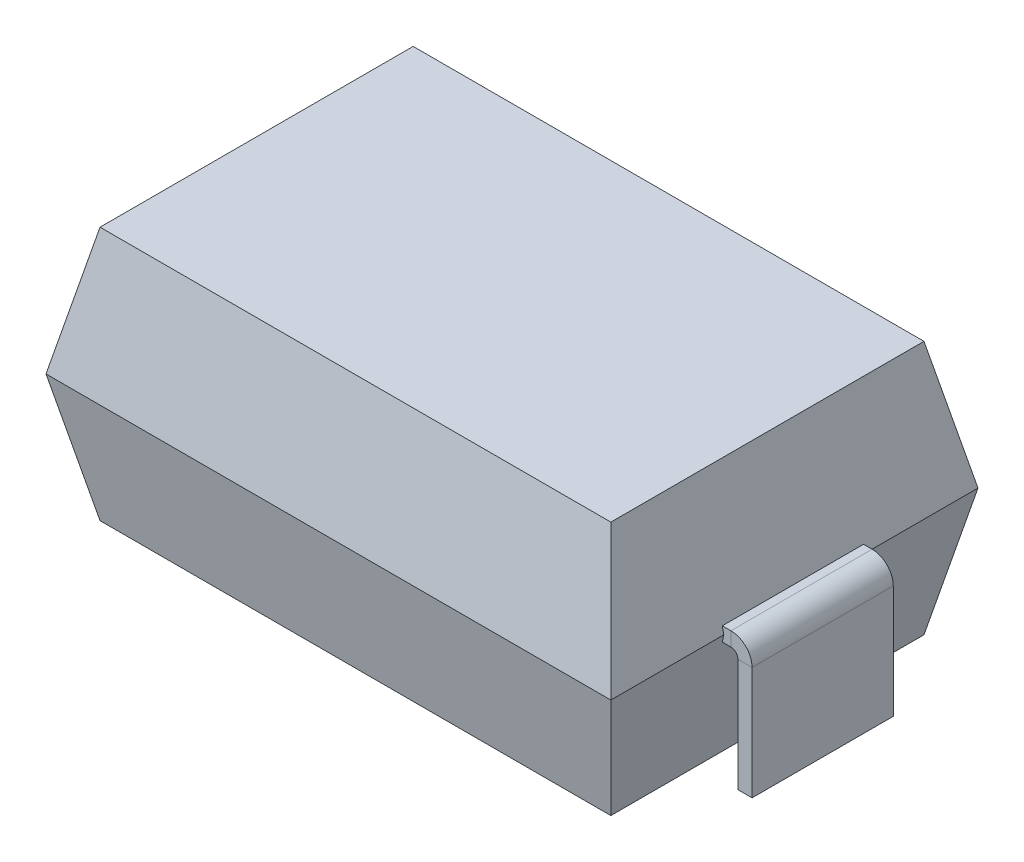
ISO-10303-21;
HEADER;
FILE_DESCRIPTION(('STEP AP214'),'2;1');
FILE_NAME('part.step','',(''),(''),'','','');
FILE_SCHEMA(('AUTOMOTIVE_DESIGN { 1 0 10303 214 1 1 1 1 }'));
ENDSEC;
DATA;
#1=APPLICATION_CONTEXT('core data for automotive mechanical design processes');
#2=APPLICATION_PROTOCOL_DEFINITION('international standard','automotive_design',2000,#1);
#3=PRODUCT_CONTEXT('',#1,'mechanical');
#4=PRODUCT('Part','Part','',(#3));
#5=PRODUCT_RELATED_PRODUCT_CATEGORY('part','',(#4));
#6=PRODUCT_DEFINITION_FORMATION('','',#4);
#7=PRODUCT_DEFINITION_CONTEXT('part definition',#1,'design');
#8=PRODUCT_DEFINITION('design','',#6,#7);
#9=PRODUCT_DEFINITION_SHAPE('','',#8);
#10=(LENGTH_UNIT() NAMED_UNIT(*) SI_UNIT(.MILLI.,.METRE.));
#11=(NAMED_UNIT(*) PLANE_ANGLE_UNIT() SI_UNIT($,.RADIAN.));
#12=(NAMED_UNIT(*) SI_UNIT($,.STERADIAN.) SOLID_ANGLE_UNIT());
#13=UNCERTAINTY_MEASURE_WITH_UNIT(LENGTH_MEASURE(1.E-05),#10,'distance_accuracy_value','');
#14=(GEOMETRIC_REPRESENTATION_CONTEXT(3) GLOBAL_UNCERTAINTY_ASSIGNED_CONTEXT((#13)) GLOBAL_UNIT_ASSIGNED_CONTEXT((#10,
#11,#12)) REPRESENTATION_CONTEXT('',''));
#15=CARTESIAN_POINT('',(0.,0.,0.));
#16=DIRECTION('',(0.,0.,1.));
#17=DIRECTION('',(1.,0.,0.));
#18=AXIS2_PLACEMENT_3D('',#15,#16,#17);
#19=CARTESIAN_POINT('',(2.,0.,-1.3));
#20=DIRECTION('',(0.978147600733806,-0.20791169081776,0.));
#21=DIRECTION('',(0.20791169081776,0.978147600733806,0.));
#22=AXIS2_PLACEMENT_3D('',#19,#20,#21);
#23=PLANE('',#22);
#24=DIRECTION('',(0.,0.,-1.));
#25=VECTOR('',#24,1.);
#26=CARTESIAN_POINT('',(2.,0.,-1.3));
#27=LINE('',#26,#25);
#28=CARTESIAN_POINT('',(2.,0.,-0.5));
#29=VERTEX_POINT('',#28);
#30=CARTESIAN_POINT('',(2.,0.,-1.3));
#31=VERTEX_POINT('',#30);
#32=EDGE_CURVE('E379',#29,#31,#27,.T.);
#33=ORIENTED_EDGE('',*,*,#32,.F.);
#34=DIRECTION('',(-0.20791169081776,-0.978147600733806,0.));
#35=VECTOR('',#34,1.);
#36=CARTESIAN_POINT('',(1.81683604466595,-0.861718659235743,-0.5));
#37=LINE('',#36,#35);
#38=CARTESIAN_POINT('',(1.9893721719165,-0.0499999999999999,-0.5));
#39=VERTEX_POINT('',#38);
#40=EDGE_CURVE('E243',#29,#39,#37,.T.);
#41=ORIENTED_EDGE('',*,*,#40,.T.);
#42=DIRECTION('',(0.,0.,1.));
#43=VECTOR('',#42,1.);
#44=CARTESIAN_POINT('',(1.9893721719165,-0.0500000000000001,0.5));
#45=LINE('',#44,#43);
#46=CARTESIAN_POINT('',(1.9893721719165,-0.0500000000000001,0.5));
#47=VERTEX_POINT('',#46);
#48=EDGE_CURVE('E233',#39,#47,#45,.T.);
#49=ORIENTED_EDGE('',*,*,#48,.T.);
#50=DIRECTION('',(0.20791169081776,0.978147600733806,0.));
#51=VECTOR('',#50,1.);
#52=CARTESIAN_POINT('',(1.83717287681974,-0.766041386353613,0.5));
#53=LINE('',#52,#51);
#54=CARTESIAN_POINT('',(2.,0.,0.5));
#55=VERTEX_POINT('',#54);
#56=EDGE_CURVE('E224',#47,#55,#53,.T.);
#57=ORIENTED_EDGE('',*,*,#56,.T.);
#58=CARTESIAN_POINT('',(2.,0.,1.3));
#59=VERTEX_POINT('',#58);
#60=EDGE_CURVE('E223',#59,#55,#27,.T.);
#61=ORIENTED_EDGE('',*,*,#60,.F.);
#62=DIRECTION('',(0.203558594952779,0.957667894857972,0.203558594952779));
#63=VECTOR('',#62,1.);
#64=CARTESIAN_POINT('',(1.8342555936834,-0.779766124434699,1.1342555936834));
#65=LINE('',#64,#63);
#66=CARTESIAN_POINT('',(1.80869909449698,-0.9,1.10869909449698));
#67=VERTEX_POINT('',#66);
#68=EDGE_CURVE('E11',#67,#59,#65,.T.);
#69=ORIENTED_EDGE('',*,*,#68,.F.);
#70=DIRECTION('',(0.,0.,-1.));
#71=VECTOR('',#70,1.);
#72=CARTESIAN_POINT('',(1.80869909449698,-0.9,0.));
#73=LINE('',#72,#71);
#74=CARTESIAN_POINT('',(1.80869909449698,-0.9,-1.10869909449698));
#75=VERTEX_POINT('',#74);
#76=EDGE_CURVE('E407',#67,#75,#73,.T.);
#77=ORIENTED_EDGE('',*,*,#76,.T.);
#78=DIRECTION('',(0.203558594952779,0.957667894857972,-0.203558594952779));
#79=VECTOR('',#78,1.);
#80=CARTESIAN_POINT('',(2.,0.,-1.3));
#81=LINE('',#80,#79);
#82=EDGE_CURVE('E409',#75,#31,#81,.T.);
#83=ORIENTED_EDGE('',*,*,#82,.T.);
#84=EDGE_LOOP('',(#33,#41,#49,#57,#61,#69,#77,#83));
#85=FACE_BOUND('',#84,.T.);
#86=ADVANCED_FACE('F37',(#85),#23,.T.);
#87=CARTESIAN_POINT('',(2.,0.,-1.3));
#88=DIRECTION('',(0.978147600733806,0.20791169081776,0.));
#89=DIRECTION('',(-0.20791169081776,0.978147600733806,0.));
#90=AXIS2_PLACEMENT_3D('',#87,#88,#89);
#91=PLANE('',#90);
#92=DIRECTION('',(0.20791169081776,-0.978147600733806,0.));
#93=VECTOR('',#92,1.);
#94=CARTESIAN_POINT('',(1.83717287681974,0.766041386353613,-0.5));
#95=LINE('',#94,#93);
#96=CARTESIAN_POINT('',(1.9893721719165,0.0500000000000001,-0.5));
#97=VERTEX_POINT('',#96);
#98=EDGE_CURVE('E54',#29,#97,#95,.F.);
#99=ORIENTED_EDGE('',*,*,#98,.F.);
#100=ORIENTED_EDGE('',*,*,#32,.T.);
#101=DIRECTION('',(0.203558594952779,-0.957667894857972,-0.203558594952779));
#102=VECTOR('',#101,1.);
#103=CARTESIAN_POINT('',(1.8342555936834,0.779766124434699,-1.1342555936834));
#104=LINE('',#103,#102);
#105=CARTESIAN_POINT('',(1.80869909449698,0.9,-1.10869909449698));
#106=VERTEX_POINT('',#105);
#107=EDGE_CURVE('E376',#106,#31,#104,.T.);
#108=ORIENTED_EDGE('',*,*,#107,.F.);
#109=DIRECTION('',(0.,0.,1.));
#110=VECTOR('',#109,1.);
#111=CARTESIAN_POINT('',(1.80869909449698,0.9,-1.3));
#112=LINE('',#111,#110);
#113=CARTESIAN_POINT('',(1.80869909449698,0.9,1.10869909449698));
#114=VERTEX_POINT('',#113);
#115=EDGE_CURVE('E375',#114,#106,#112,.F.);
#116=ORIENTED_EDGE('',*,*,#115,.F.);
#117=DIRECTION('',(0.203558594952779,-0.957667894857972,0.203558594952779));
#118=VECTOR('',#117,1.);
#119=CARTESIAN_POINT('',(1.89226613589421,0.506847980882555,1.19226613589421));
#120=LINE('',#119,#118);
#121=EDGE_CURVE('E381',#114,#59,#120,.T.);
#122=ORIENTED_EDGE('',*,*,#121,.T.);
#123=ORIENTED_EDGE('',*,*,#60,.T.);
#124=DIRECTION('',(-0.20791169081776,0.978147600733806,0.));
#125=VECTOR('',#124,1.);
#126=CARTESIAN_POINT('',(1.81683604466595,0.861718659235743,0.5));
#127=LINE('',#126,#125);
#128=CARTESIAN_POINT('',(1.9893721719165,0.0499999999999999,0.5));
#129=VERTEX_POINT('',#128);
#130=EDGE_CURVE('E205',#129,#55,#127,.F.);
#131=ORIENTED_EDGE('',*,*,#130,.F.);
#132=DIRECTION('',(0.,0.,-1.));
#133=VECTOR('',#132,1.);
#134=CARTESIAN_POINT('',(1.9893721719165,0.0500000000000001,-0.5));
#135=LINE('',#134,#133);
#136=EDGE_CURVE('E214',#97,#129,#135,.F.);
#137=ORIENTED_EDGE('',*,*,#136,.F.);
#138=EDGE_LOOP('',(#99,#100,#108,#116,#122,#123,#131,#137));
#139=FACE_BOUND('',#138,.T.);
#140=ADVANCED_FACE('F221',(#139),#91,.T.);
#141=CARTESIAN_POINT('',(-2.,0.,-1.3));
#142=DIRECTION('',(-0.978147600733806,0.20791169081776,0.));
#143=DIRECTION('',(-0.20791169081776,-0.978147600733806,0.));
#144=AXIS2_PLACEMENT_3D('',#141,#142,#143);
#145=PLANE('',#144);
#146=DIRECTION('',(-0.20791169081776,-0.978147600733806,0.));
#147=VECTOR('',#146,1.);
#148=CARTESIAN_POINT('',(-1.83717287681974,0.766041386353613,-0.5));
#149=LINE('',#148,#147);
#150=CARTESIAN_POINT('',(-2.,0.,-0.5));
#151=VERTEX_POINT('',#150);
#152=CARTESIAN_POINT('',(-1.9893721719165,0.0500000000000001,-0.5));
#153=VERTEX_POINT('',#152);
#154=EDGE_CURVE('E294',#151,#153,#149,.F.);
#155=ORIENTED_EDGE('',*,*,#154,.T.);
#156=DIRECTION('',(0.,0.,-1.));
#157=VECTOR('',#156,1.);
#158=CARTESIAN_POINT('',(-1.9893721719165,0.0500000000000001,-0.5));
#159=LINE('',#158,#157);
#160=CARTESIAN_POINT('',(-1.9893721719165,0.0499999999999999,0.5));
#161=VERTEX_POINT('',#160);
#162=EDGE_CURVE('E293',#153,#161,#159,.F.);
#163=ORIENTED_EDGE('',*,*,#162,.T.);
#164=DIRECTION('',(0.20791169081776,0.978147600733806,0.));
#165=VECTOR('',#164,1.);
#166=CARTESIAN_POINT('',(-1.81683604466595,0.861718659235743,0.5));
#167=LINE('',#166,#165);
#168=CARTESIAN_POINT('',(-2.,0.,0.5));
#169=VERTEX_POINT('',#168);
#170=EDGE_CURVE('E297',#161,#169,#167,.F.);
#171=ORIENTED_EDGE('',*,*,#170,.T.);
#172=DIRECTION('',(0.,0.,1.));
#173=VECTOR('',#172,1.);
#174=CARTESIAN_POINT('',(-2.,0.,-1.3));
#175=LINE('',#174,#173);
#176=CARTESIAN_POINT('',(-2.,0.,1.3));
#177=VERTEX_POINT('',#176);
#178=EDGE_CURVE('E401',#169,#177,#175,.T.);
#179=ORIENTED_EDGE('',*,*,#178,.T.);
#180=DIRECTION('',(-0.203558594952779,-0.957667894857972,0.203558594952779));
#181=VECTOR('',#180,1.);
#182=CARTESIAN_POINT('',(-2.,0.,1.3));
#183=LINE('',#182,#181);
#184=CARTESIAN_POINT('',(-1.80869909449698,0.9,1.10869909449698));
#185=VERTEX_POINT('',#184);
#186=EDGE_CURVE('E383',#185,#177,#183,.T.);
#187=ORIENTED_EDGE('',*,*,#186,.F.);
#188=DIRECTION('',(0.,0.,-1.));
#189=VECTOR('',#188,1.);
#190=CARTESIAN_POINT('',(-1.80869909449698,0.9,-1.3));
#191=LINE('',#190,#189);
#192=CARTESIAN_POINT('',(-1.80869909449698,0.9,-1.10869909449698));
#193=VERTEX_POINT('',#192);
#194=EDGE_CURVE('E393',#193,#185,#191,.F.);
#195=ORIENTED_EDGE('',*,*,#194,.F.);
#196=DIRECTION('',(-0.203558594952779,-0.957667894857972,-0.203558594952779));
#197=VECTOR('',#196,1.);
#198=CARTESIAN_POINT('',(-2.,0.,-1.3));
#199=LINE('',#198,#197);
#200=CARTESIAN_POINT('',(-2.,0.,-1.3));
#201=VERTEX_POINT('',#200);
#202=EDGE_CURVE('E380',#193,#201,#199,.T.);
#203=ORIENTED_EDGE('',*,*,#202,.T.);
#204=EDGE_CURVE('E402',#201,#151,#175,.T.);
#205=ORIENTED_EDGE('',*,*,#204,.T.);
#206=EDGE_LOOP('',(#155,#163,#171,#179,#187,#195,#203,#205));
#207=FACE_BOUND('',#206,.T.);
#208=ADVANCED_FACE('F451',(#207),#145,.T.);
#209=CARTESIAN_POINT('',(-2.,0.,1.3));
#210=DIRECTION('',(0.,-0.20791169081776,0.978147600733806));
#211=DIRECTION('',(0.,-0.978147600733806,-0.20791169081776));
#212=AXIS2_PLACEMENT_3D('',#209,#210,#211);
#213=PLANE('',#212);
#214=DIRECTION('',(1.,0.,0.));
#215=VECTOR('',#214,1.);
#216=CARTESIAN_POINT('',(-2.,0.,1.3));
#217=LINE('',#216,#215);
#218=EDGE_CURVE('E405',#177,#59,#217,.T.);
#219=ORIENTED_EDGE('',*,*,#218,.F.);
#220=DIRECTION('',(-0.203558594952779,0.957667894857972,0.203558594952779));
#221=VECTOR('',#220,1.);
#222=CARTESIAN_POINT('',(-1.89226613589421,-0.506847980882555,1.19226613589421));
#223=LINE('',#222,#221);
#224=CARTESIAN_POINT('',(-1.80869909449698,-0.9,1.10869909449698));
#225=VERTEX_POINT('',#224);
#226=EDGE_CURVE('E46',#225,#177,#223,.T.);
#227=ORIENTED_EDGE('',*,*,#226,.F.);
#228=DIRECTION('',(1.,0.,0.));
#229=VECTOR('',#228,1.);
#230=CARTESIAN_POINT('',(0.,-0.9,1.10869909449698));
#231=LINE('',#230,#229);
#232=EDGE_CURVE('E413',#225,#67,#231,.T.);
#233=ORIENTED_EDGE('',*,*,#232,.T.);
#234=ORIENTED_EDGE('',*,*,#68,.T.);
#235=EDGE_LOOP('',(#219,#227,#233,#234));
#236=FACE_BOUND('',#235,.T.);
#237=ADVANCED_FACE('F39',(#236),#213,.T.);
#238=CARTESIAN_POINT('',(-2.,0.,-1.3));
#239=DIRECTION('',(-0.978147600733806,-0.20791169081776,0.));
#240=DIRECTION('',(0.20791169081776,-0.978147600733806,0.));
#241=AXIS2_PLACEMENT_3D('',#238,#239,#240);
#242=PLANE('',#241);
#243=DIRECTION('',(0.20791169081776,-0.978147600733806,0.));
#244=VECTOR('',#243,1.);
#245=CARTESIAN_POINT('',(-1.81683604466595,-0.861718659235743,-0.5));
#246=LINE('',#245,#244);
#247=CARTESIAN_POINT('',(-1.9893721719165,-0.0499999999999999,-0.5));
#248=VERTEX_POINT('',#247);
#249=EDGE_CURVE('E366',#151,#248,#246,.T.);
#250=ORIENTED_EDGE('',*,*,#249,.F.);
#251=ORIENTED_EDGE('',*,*,#204,.F.);
#252=DIRECTION('',(-0.203558594952779,0.957667894857972,-0.203558594952779));
#253=VECTOR('',#252,1.);
#254=CARTESIAN_POINT('',(-2.,0.,-1.3));
#255=LINE('',#254,#253);
#256=CARTESIAN_POINT('',(-1.80869909449698,-0.9,-1.10869909449698));
#257=VERTEX_POINT('',#256);
#258=EDGE_CURVE('E412',#257,#201,#255,.T.);
#259=ORIENTED_EDGE('',*,*,#258,.F.);
#260=DIRECTION('',(0.,0.,1.));
#261=VECTOR('',#260,1.);
#262=CARTESIAN_POINT('',(-1.80869909449698,-0.9,0.));
#263=LINE('',#262,#261);
#264=EDGE_CURVE('E420',#257,#225,#263,.T.);
#265=ORIENTED_EDGE('',*,*,#264,.T.);
#266=ORIENTED_EDGE('',*,*,#226,.T.);
#267=ORIENTED_EDGE('',*,*,#178,.F.);
#268=DIRECTION('',(-0.20791169081776,0.978147600733806,0.));
#269=VECTOR('',#268,1.);
#270=CARTESIAN_POINT('',(-1.83717287681974,-0.766041386353613,0.5));
#271=LINE('',#270,#269);
#272=CARTESIAN_POINT('',(-1.9893721719165,-0.0500000000000001,0.5));
#273=VERTEX_POINT('',#272);
#274=EDGE_CURVE('E372',#273,#169,#271,.T.);
#275=ORIENTED_EDGE('',*,*,#274,.F.);
#276=DIRECTION('',(0.,0.,1.));
#277=VECTOR('',#276,1.);
#278=CARTESIAN_POINT('',(-1.9893721719165,-0.0500000000000001,0.5));
#279=LINE('',#278,#277);
#280=EDGE_CURVE('E369',#248,#273,#279,.T.);
#281=ORIENTED_EDGE('',*,*,#280,.F.);
#282=EDGE_LOOP('',(#250,#251,#259,#265,#266,#267,#275,#281));
#283=FACE_BOUND('',#282,.T.);
#284=ADVANCED_FACE('F454',(#283),#242,.T.);
#285=CARTESIAN_POINT('',(-2.,0.,-1.3));
#286=DIRECTION('',(0.,-0.20791169081776,-0.978147600733806));
#287=DIRECTION('',(0.,0.978147600733806,-0.20791169081776));
#288=AXIS2_PLACEMENT_3D('',#285,#286,#287);
#289=PLANE('',#288);
#290=DIRECTION('',(-1.,0.,0.));
#291=VECTOR('',#290,1.);
#292=CARTESIAN_POINT('',(-2.,0.,-1.3));
#293=LINE('',#292,#291);
#294=EDGE_CURVE('E397',#31,#201,#293,.T.);
#295=ORIENTED_EDGE('',*,*,#294,.F.);
#296=ORIENTED_EDGE('',*,*,#82,.F.);
#297=DIRECTION('',(-1.,0.,0.));
#298=VECTOR('',#297,1.);
#299=CARTESIAN_POINT('',(0.,-0.9,-1.10869909449698));
#300=LINE('',#299,#298);
#301=EDGE_CURVE('E41',#75,#257,#300,.T.);
#302=ORIENTED_EDGE('',*,*,#301,.T.);
#303=ORIENTED_EDGE('',*,*,#258,.T.);
#304=EDGE_LOOP('',(#295,#296,#302,#303));
#305=FACE_BOUND('',#304,.T.);
#306=ADVANCED_FACE('F430',(#305),#289,.T.);
#307=CARTESIAN_POINT('',(0.,-0.9,0.));
#308=DIRECTION('',(0.,1.,0.));
#309=DIRECTION('',(0.,0.,1.));
#310=AXIS2_PLACEMENT_3D('',#307,#308,#309);
#311=PLANE('',#310);
#312=ORIENTED_EDGE('',*,*,#76,.F.);
#313=ORIENTED_EDGE('',*,*,#232,.F.);
#314=ORIENTED_EDGE('',*,*,#264,.F.);
#315=ORIENTED_EDGE('',*,*,#301,.F.);
#316=EDGE_LOOP('',(#312,#313,#314,#315));
#317=FACE_BOUND('',#316,.T.);
#318=ADVANCED_FACE('F434',(#317),#311,.F.);
#319=CARTESIAN_POINT('',(-2.,0.,-1.3));
#320=DIRECTION('',(0.,0.20791169081776,-0.978147600733806));
#321=DIRECTION('',(0.,0.978147600733806,0.20791169081776));
#322=AXIS2_PLACEMENT_3D('',#319,#320,#321);
#323=PLANE('',#322);
#324=ORIENTED_EDGE('',*,*,#294,.T.);
#325=ORIENTED_EDGE('',*,*,#202,.F.);
#326=DIRECTION('',(1.,0.,0.));
#327=VECTOR('',#326,1.);
#328=CARTESIAN_POINT('',(-2.,0.9,-1.10869909449698));
#329=LINE('',#328,#327);
#330=EDGE_CURVE('E391',#106,#193,#329,.F.);
#331=ORIENTED_EDGE('',*,*,#330,.F.);
#332=ORIENTED_EDGE('',*,*,#107,.T.);
#333=EDGE_LOOP('',(#324,#325,#331,#332));
#334=FACE_BOUND('',#333,.T.);
#335=ADVANCED_FACE('F470',(#334),#323,.T.);
#336=CARTESIAN_POINT('',(-2.,0.,1.3));
#337=DIRECTION('',(0.,0.20791169081776,0.978147600733806));
#338=DIRECTION('',(0.,-0.978147600733806,0.20791169081776));
#339=AXIS2_PLACEMENT_3D('',#336,#337,#338);
#340=PLANE('',#339);
#341=ORIENTED_EDGE('',*,*,#218,.T.);
#342=ORIENTED_EDGE('',*,*,#121,.F.);
#343=DIRECTION('',(-1.,0.,0.));
#344=VECTOR('',#343,1.);
#345=CARTESIAN_POINT('',(-2.,0.9,1.10869909449698));
#346=LINE('',#345,#344);
#347=EDGE_CURVE('E384',#185,#114,#346,.F.);
#348=ORIENTED_EDGE('',*,*,#347,.F.);
#349=ORIENTED_EDGE('',*,*,#186,.T.);
#350=EDGE_LOOP('',(#341,#342,#348,#349));
#351=FACE_BOUND('',#350,.T.);
#352=ADVANCED_FACE('F441',(#351),#340,.T.);
#353=CARTESIAN_POINT('',(0.,0.9,0.));
#354=DIRECTION('',(0.,1.,0.));
#355=DIRECTION('',(0.,0.,1.));
#356=AXIS2_PLACEMENT_3D('',#353,#354,#355);
#357=PLANE('',#356);
#358=ORIENTED_EDGE('',*,*,#115,.T.);
#359=ORIENTED_EDGE('',*,*,#330,.T.);
#360=ORIENTED_EDGE('',*,*,#194,.T.);
#361=ORIENTED_EDGE('',*,*,#347,.T.);
#362=EDGE_LOOP('',(#358,#359,#360,#361));
#363=FACE_BOUND('',#362,.T.);
#364=ADVANCED_FACE('F447',(#363),#357,.T.);
#365=CARTESIAN_POINT('',(2.002,-0.0500000000000001,0.5));
#366=DIRECTION('',(0.,1.,0.));
#367=DIRECTION('',(0.,0.,1.));
#368=AXIS2_PLACEMENT_3D('',#365,#366,#367);
#369=PLANE('',#368);
#370=DIRECTION('',(-1.,0.,0.));
#371=VECTOR('',#370,1.);
#372=CARTESIAN_POINT('',(2.002,-0.0499999999999999,-0.5));
#373=LINE('',#372,#371);
#374=CARTESIAN_POINT('',(-2.05,-0.0500000000000003,-0.5));
#375=VERTEX_POINT('',#374);
#376=EDGE_CURVE('E356',#248,#375,#373,.T.);
#377=ORIENTED_EDGE('',*,*,#376,.F.);
#378=ORIENTED_EDGE('',*,*,#280,.T.);
#379=DIRECTION('',(-1.,0.,0.));
#380=VECTOR('',#379,1.);
#381=CARTESIAN_POINT('',(2.002,-0.0500000000000001,0.5));
#382=LINE('',#381,#380);
#383=CARTESIAN_POINT('',(-2.05,-0.0500000000000003,0.5));
#384=VERTEX_POINT('',#383);
#385=EDGE_CURVE('E364',#273,#384,#382,.T.);
#386=ORIENTED_EDGE('',*,*,#385,.T.);
#387=DIRECTION('',(0.,0.,-1.));
#388=VECTOR('',#387,1.);
#389=CARTESIAN_POINT('',(-2.05,-0.05,-0.5));
#390=LINE('',#389,#388);
#391=EDGE_CURVE('E322',#384,#375,#390,.T.);
#392=ORIENTED_EDGE('',*,*,#391,.T.);
#393=EDGE_LOOP('',(#377,#378,#386,#392));
#394=FACE_BOUND('',#393,.T.);
#395=ADVANCED_FACE('F480',(#394),#369,.F.);
#396=CARTESIAN_POINT('',(2.002,-0.0499999999999999,-0.5));
#397=DIRECTION('',(0.,0.,1.));
#398=DIRECTION('',(1.,0.,0.));
#399=AXIS2_PLACEMENT_3D('',#396,#397,#398);
#400=PLANE('',#399);
#401=ORIENTED_EDGE('',*,*,#376,.T.);
#402=DIRECTION('',(0.,1.,0.));
#403=VECTOR('',#402,1.);
#404=CARTESIAN_POINT('',(-2.05,0.05,-0.5));
#405=LINE('',#404,#403);
#406=CARTESIAN_POINT('',(-2.05,0.05,-0.5));
#407=VERTEX_POINT('',#406);
#408=EDGE_CURVE('E343',#375,#407,#405,.T.);
#409=ORIENTED_EDGE('',*,*,#408,.T.);
#410=DIRECTION('',(1.,0.,0.));
#411=VECTOR('',#410,1.);
#412=CARTESIAN_POINT('',(-2.05,0.0500000000000001,-0.5));
#413=LINE('',#412,#411);
#414=EDGE_CURVE('E62',#407,#153,#413,.T.);
#415=ORIENTED_EDGE('',*,*,#414,.T.);
#416=ORIENTED_EDGE('',*,*,#154,.F.);
#417=ORIENTED_EDGE('',*,*,#249,.T.);
#418=EDGE_LOOP('',(#401,#409,#415,#416,#417));
#419=FACE_BOUND('',#418,.T.);
#420=ADVANCED_FACE('F485',(#419),#400,.F.);
#421=CARTESIAN_POINT('',(2.002,0.0499999999999999,0.5));
#422=DIRECTION('',(0.,0.,-1.));
#423=DIRECTION('',(-1.,0.,0.));
#424=AXIS2_PLACEMENT_3D('',#421,#422,#423);
#425=PLANE('',#424);
#426=ORIENTED_EDGE('',*,*,#385,.F.);
#427=ORIENTED_EDGE('',*,*,#274,.T.);
#428=ORIENTED_EDGE('',*,*,#170,.F.);
#429=DIRECTION('',(1.,0.,0.));
#430=VECTOR('',#429,1.);
#431=CARTESIAN_POINT('',(-2.05,0.0499999999999999,0.5));
#432=LINE('',#431,#430);
#433=CARTESIAN_POINT('',(-2.05,0.05,0.5));
#434=VERTEX_POINT('',#433);
#435=EDGE_CURVE('E326',#434,#161,#432,.T.);
#436=ORIENTED_EDGE('',*,*,#435,.F.);
#437=DIRECTION('',(0.,-1.,0.));
#438=VECTOR('',#437,1.);
#439=CARTESIAN_POINT('',(-2.05,0.0499999999999998,0.5));
#440=LINE('',#439,#438);
#441=EDGE_CURVE('E315',#434,#384,#440,.T.);
#442=ORIENTED_EDGE('',*,*,#441,.T.);
#443=EDGE_LOOP('',(#426,#427,#428,#436,#442));
#444=FACE_BOUND('',#443,.T.);
#445=ADVANCED_FACE('F481',(#444),#425,.F.);
#446=CARTESIAN_POINT('',(-2.15,-0.9,0.));
#447=DIRECTION('',(0.,-1.,0.));
#448=DIRECTION('',(0.,0.,1.));
#449=AXIS2_PLACEMENT_3D('',#446,#447,#448);
#450=PLANE('',#449);
#451=DIRECTION('',(1.,0.,0.));
#452=VECTOR('',#451,1.);
#453=CARTESIAN_POINT('',(-2.2,-0.9,0.5));
#454=LINE('',#453,#452);
#455=CARTESIAN_POINT('',(-2.2,-0.9,0.5));
#456=VERTEX_POINT('',#455);
#457=CARTESIAN_POINT('',(-2.1,-0.9,0.5));
#458=VERTEX_POINT('',#457);
#459=EDGE_CURVE('E296',#456,#458,#454,.T.);
#460=ORIENTED_EDGE('',*,*,#459,.F.);
#461=DIRECTION('',(0.,0.,1.));
#462=VECTOR('',#461,1.);
#463=CARTESIAN_POINT('',(-2.2,-0.9,-0.5));
#464=LINE('',#463,#462);
#465=CARTESIAN_POINT('',(-2.2,-0.9,-0.5));
#466=VERTEX_POINT('',#465);
#467=EDGE_CURVE('E314',#466,#456,#464,.T.);
#468=ORIENTED_EDGE('',*,*,#467,.F.);
#469=DIRECTION('',(-1.,0.,0.));
#470=VECTOR('',#469,1.);
#471=CARTESIAN_POINT('',(-2.2,-0.9,-0.5));
#472=LINE('',#471,#470);
#473=CARTESIAN_POINT('',(-2.1,-0.9,-0.5));
#474=VERTEX_POINT('',#473);
#475=EDGE_CURVE('E331',#474,#466,#472,.T.);
#476=ORIENTED_EDGE('',*,*,#475,.F.);
#477=DIRECTION('',(0.,0.,-1.));
#478=VECTOR('',#477,1.);
#479=CARTESIAN_POINT('',(-2.1,-0.9,-0.5));
#480=LINE('',#479,#478);
#481=EDGE_CURVE('E303',#458,#474,#480,.T.);
#482=ORIENTED_EDGE('',*,*,#481,.F.);
#483=EDGE_LOOP('',(#460,#468,#476,#482));
#484=FACE_BOUND('',#483,.T.);
#485=ADVANCED_FACE('F484',(#484),#450,.T.);
#486=CARTESIAN_POINT('',(-2.2,-0.9,0.5));
#487=DIRECTION('',(0.,0.,1.));
#488=DIRECTION('',(1.,0.,0.));
#489=AXIS2_PLACEMENT_3D('',#486,#487,#488);
#490=PLANE('',#489);
#491=DIRECTION('',(0.,1.,0.));
#492=VECTOR('',#491,1.);
#493=CARTESIAN_POINT('',(-2.1,-0.9,0.5));
#494=LINE('',#493,#492);
#495=CARTESIAN_POINT('',(-2.1,-0.1,0.5));
#496=VERTEX_POINT('',#495);
#497=EDGE_CURVE('E307',#458,#496,#494,.T.);
#498=ORIENTED_EDGE('',*,*,#497,.T.);
#499=DIRECTION('',(1.,0.,0.));
#500=VECTOR('',#499,1.);
#501=CARTESIAN_POINT('',(-2.2,-0.1,0.5));
#502=LINE('',#501,#500);
#503=CARTESIAN_POINT('',(-2.2,-0.1,0.5));
#504=VERTEX_POINT('',#503);
#505=EDGE_CURVE('E304',#504,#496,#502,.T.);
#506=ORIENTED_EDGE('',*,*,#505,.F.);
#507=DIRECTION('',(0.,1.,0.));
#508=VECTOR('',#507,1.);
#509=CARTESIAN_POINT('',(-2.2,-0.9,0.5));
#510=LINE('',#509,#508);
#511=EDGE_CURVE('E308',#456,#504,#510,.T.);
#512=ORIENTED_EDGE('',*,*,#511,.F.);
#513=ORIENTED_EDGE('',*,*,#459,.T.);
#514=EDGE_LOOP('',(#498,#506,#512,#513));
#515=FACE_BOUND('',#514,.T.);
#516=ADVANCED_FACE('F495',(#515),#490,.T.);
#517=CARTESIAN_POINT('',(-2.1,-0.9,-0.5));
#518=DIRECTION('',(1.,0.,0.));
#519=DIRECTION('',(0.,0.,-1.));
#520=AXIS2_PLACEMENT_3D('',#517,#518,#519);
#521=PLANE('',#520);
#522=DIRECTION('',(0.,1.,0.));
#523=VECTOR('',#522,1.);
#524=CARTESIAN_POINT('',(-2.1,-0.9,-0.5));
#525=LINE('',#524,#523);
#526=CARTESIAN_POINT('',(-2.1,-0.1,-0.5));
#527=VERTEX_POINT('',#526);
#528=EDGE_CURVE('E334',#474,#527,#525,.T.);
#529=ORIENTED_EDGE('',*,*,#528,.T.);
#530=DIRECTION('',(0.,0.,-1.));
#531=VECTOR('',#530,1.);
#532=CARTESIAN_POINT('',(-2.1,-0.1,-0.5));
#533=LINE('',#532,#531);
#534=EDGE_CURVE('E311',#496,#527,#533,.T.);
#535=ORIENTED_EDGE('',*,*,#534,.F.);
#536=ORIENTED_EDGE('',*,*,#497,.F.);
#537=ORIENTED_EDGE('',*,*,#481,.T.);
#538=EDGE_LOOP('',(#529,#535,#536,#537));
#539=FACE_BOUND('',#538,.T.);
#540=ADVANCED_FACE('F518',(#539),#521,.T.);
#541=CARTESIAN_POINT('',(-2.2,-0.9,-0.5));
#542=DIRECTION('',(0.,0.,-1.));
#543=DIRECTION('',(-1.,0.,0.));
#544=AXIS2_PLACEMENT_3D('',#541,#542,#543);
#545=PLANE('',#544);
#546=DIRECTION('',(0.,1.,0.));
#547=VECTOR('',#546,1.);
#548=CARTESIAN_POINT('',(-2.2,-0.9,-0.5));
#549=LINE('',#548,#547);
#550=CARTESIAN_POINT('',(-2.2,-0.1,-0.5));
#551=VERTEX_POINT('',#550);
#552=EDGE_CURVE('E348',#466,#551,#549,.T.);
#553=ORIENTED_EDGE('',*,*,#552,.T.);
#554=DIRECTION('',(-1.,0.,0.));
#555=VECTOR('',#554,1.);
#556=CARTESIAN_POINT('',(-2.2,-0.1,-0.5));
#557=LINE('',#556,#555);
#558=EDGE_CURVE('E337',#527,#551,#557,.T.);
#559=ORIENTED_EDGE('',*,*,#558,.F.);
#560=ORIENTED_EDGE('',*,*,#528,.F.);
#561=ORIENTED_EDGE('',*,*,#475,.T.);
#562=EDGE_LOOP('',(#553,#559,#560,#561));
#563=FACE_BOUND('',#562,.T.);
#564=ADVANCED_FACE('F510',(#563),#545,.T.);
#565=CARTESIAN_POINT('',(-2.2,-0.9,-0.5));
#566=DIRECTION('',(-1.,0.,0.));
#567=DIRECTION('',(0.,0.,1.));
#568=AXIS2_PLACEMENT_3D('',#565,#566,#567);
#569=PLANE('',#568);
#570=DIRECTION('',(0.,0.,1.));
#571=VECTOR('',#570,1.);
#572=CARTESIAN_POINT('',(-2.2,-0.1,-0.5));
#573=LINE('',#572,#571);
#574=EDGE_CURVE('E325',#551,#504,#573,.T.);
#575=ORIENTED_EDGE('',*,*,#574,.F.);
#576=ORIENTED_EDGE('',*,*,#552,.F.);
#577=ORIENTED_EDGE('',*,*,#467,.T.);
#578=ORIENTED_EDGE('',*,*,#511,.T.);
#579=EDGE_LOOP('',(#575,#576,#577,#578));
#580=FACE_BOUND('',#579,.T.);
#581=ADVANCED_FACE('F506',(#580),#569,.T.);
#582=CARTESIAN_POINT('',(-2.2,-0.1,0.5));
#583=DIRECTION('',(0.,0.,1.));
#584=DIRECTION('',(1.,0.,0.));
#585=AXIS2_PLACEMENT_3D('',#582,#583,#584);
#586=PLANE('',#585);
#587=CARTESIAN_POINT('',(-2.05,-0.1,0.5));
#588=DIRECTION('',(0.,0.,-1.));
#589=DIRECTION('',(-1.,0.,0.));
#590=AXIS2_PLACEMENT_3D('',#587,#588,#589);
#591=CIRCLE('',#590,0.0499999999999997);
#592=EDGE_CURVE('E318',#496,#384,#591,.T.);
#593=ORIENTED_EDGE('',*,*,#592,.T.);
#594=ORIENTED_EDGE('',*,*,#441,.F.);
#595=CARTESIAN_POINT('',(-2.05,-0.1,0.5));
#596=DIRECTION('',(0.,0.,-1.));
#597=DIRECTION('',(-1.,0.,0.));
#598=AXIS2_PLACEMENT_3D('',#595,#596,#597);
#599=CIRCLE('',#598,0.15);
#600=EDGE_CURVE('E319',#504,#434,#599,.T.);
#601=ORIENTED_EDGE('',*,*,#600,.F.);
#602=ORIENTED_EDGE('',*,*,#505,.T.);
#603=EDGE_LOOP('',(#593,#594,#601,#602));
#604=FACE_BOUND('',#603,.T.);
#605=ADVANCED_FACE('F509',(#604),#586,.T.);
#606=CARTESIAN_POINT('',(-2.05,-0.1,0.));
#607=DIRECTION('',(0.,0.,-1.));
#608=DIRECTION('',(-1.,0.,0.));
#609=AXIS2_PLACEMENT_3D('',#606,#607,#608);
#610=CYLINDRICAL_SURFACE('',#609,0.0499999999999997);
#611=CARTESIAN_POINT('',(-2.05,-0.1,-0.5));
#612=DIRECTION('',(0.,0.,-1.));
#613=DIRECTION('',(-1.,0.,0.));
#614=AXIS2_PLACEMENT_3D('',#611,#612,#613);
#615=CIRCLE('',#614,0.0499999999999997);
#616=EDGE_CURVE('E340',#527,#375,#615,.T.);
#617=ORIENTED_EDGE('',*,*,#616,.T.);
#618=ORIENTED_EDGE('',*,*,#391,.F.);
#619=ORIENTED_EDGE('',*,*,#592,.F.);
#620=ORIENTED_EDGE('',*,*,#534,.T.);
#621=EDGE_LOOP('',(#617,#618,#619,#620));
#622=FACE_BOUND('',#621,.T.);
#623=ADVANCED_FACE('F514',(#622),#610,.F.);
#624=CARTESIAN_POINT('',(-2.2,-0.1,-0.5));
#625=DIRECTION('',(0.,0.,-1.));
#626=DIRECTION('',(-1.,0.,0.));
#627=AXIS2_PLACEMENT_3D('',#624,#625,#626);
#628=PLANE('',#627);
#629=CARTESIAN_POINT('',(-2.05,-0.1,-0.5));
#630=DIRECTION('',(0.,0.,-1.));
#631=DIRECTION('',(-1.,0.,0.));
#632=AXIS2_PLACEMENT_3D('',#629,#630,#631);
#633=CIRCLE('',#632,0.15);
#634=EDGE_CURVE('E352',#551,#407,#633,.T.);
#635=ORIENTED_EDGE('',*,*,#634,.T.);
#636=ORIENTED_EDGE('',*,*,#408,.F.);
#637=ORIENTED_EDGE('',*,*,#616,.F.);
#638=ORIENTED_EDGE('',*,*,#558,.T.);
#639=EDGE_LOOP('',(#635,#636,#637,#638));
#640=FACE_BOUND('',#639,.T.);
#641=ADVANCED_FACE('F504',(#640),#628,.T.);
#642=CARTESIAN_POINT('',(-2.05,-0.1,0.));
#643=DIRECTION('',(0.,0.,-1.));
#644=DIRECTION('',(-1.,0.,0.));
#645=AXIS2_PLACEMENT_3D('',#642,#643,#644);
#646=CYLINDRICAL_SURFACE('',#645,0.15);
#647=DIRECTION('',(0.,0.,1.));
#648=VECTOR('',#647,1.);
#649=CARTESIAN_POINT('',(-2.05,0.05,-0.5));
#650=LINE('',#649,#648);
#651=EDGE_CURVE('E328',#407,#434,#650,.T.);
#652=ORIENTED_EDGE('',*,*,#651,.F.);
#653=ORIENTED_EDGE('',*,*,#634,.F.);
#654=ORIENTED_EDGE('',*,*,#574,.T.);
#655=ORIENTED_EDGE('',*,*,#600,.T.);
#656=EDGE_LOOP('',(#652,#653,#654,#655));
#657=FACE_BOUND('',#656,.T.);
#658=ADVANCED_FACE('F500',(#657),#646,.T.);
#659=CARTESIAN_POINT('',(-2.05,0.0500000000000001,-0.5));
#660=DIRECTION('',(0.,1.,0.));
#661=DIRECTION('',(0.,0.,1.));
#662=AXIS2_PLACEMENT_3D('',#659,#660,#661);
#663=PLANE('',#662);
#664=ORIENTED_EDGE('',*,*,#435,.T.);
#665=ORIENTED_EDGE('',*,*,#162,.F.);
#666=ORIENTED_EDGE('',*,*,#414,.F.);
#667=ORIENTED_EDGE('',*,*,#651,.T.);
#668=EDGE_LOOP('',(#664,#665,#666,#667));
#669=FACE_BOUND('',#668,.T.);
#670=ADVANCED_FACE('F490',(#669),#663,.T.);
#671=CARTESIAN_POINT('',(2.15,-0.9,0.));
#672=DIRECTION('',(0.,-1.,0.));
#673=DIRECTION('',(0.,0.,1.));
#674=AXIS2_PLACEMENT_3D('',#671,#672,#673);
#675=PLANE('',#674);
#676=DIRECTION('',(-1.,0.,0.));
#677=VECTOR('',#676,1.);
#678=CARTESIAN_POINT('',(2.2,-0.9,0.5));
#679=LINE('',#678,#677);
#680=CARTESIAN_POINT('',(2.2,-0.9,0.5));
#681=VERTEX_POINT('',#680);
#682=CARTESIAN_POINT('',(2.1,-0.9,0.5));
#683=VERTEX_POINT('',#682);
#684=EDGE_CURVE('E290',#681,#683,#679,.T.);
#685=ORIENTED_EDGE('',*,*,#684,.T.);
#686=DIRECTION('',(0.,0.,-1.));
#687=VECTOR('',#686,1.);
#688=CARTESIAN_POINT('',(2.1,-0.9,-0.5));
#689=LINE('',#688,#687);
#690=CARTESIAN_POINT('',(2.1,-0.9,-0.5));
#691=VERTEX_POINT('',#690);
#692=EDGE_CURVE('E287',#683,#691,#689,.T.);
#693=ORIENTED_EDGE('',*,*,#692,.T.);
#694=DIRECTION('',(1.,0.,0.));
#695=VECTOR('',#694,1.);
#696=CARTESIAN_POINT('',(2.2,-0.9,-0.5));
#697=LINE('',#696,#695);
#698=CARTESIAN_POINT('',(2.2,-0.9,-0.5));
#699=VERTEX_POINT('',#698);
#700=EDGE_CURVE('E281',#691,#699,#697,.T.);
#701=ORIENTED_EDGE('',*,*,#700,.T.);
#702=DIRECTION('',(0.,0.,1.));
#703=VECTOR('',#702,1.);
#704=CARTESIAN_POINT('',(2.2,-0.9,-0.5));
#705=LINE('',#704,#703);
#706=EDGE_CURVE('E272',#699,#681,#705,.T.);
#707=ORIENTED_EDGE('',*,*,#706,.T.);
#708=EDGE_LOOP('',(#685,#693,#701,#707));
#709=FACE_BOUND('',#708,.T.);
#710=ADVANCED_FACE('F497',(#709),#675,.T.);
#711=CARTESIAN_POINT('',(2.2,-0.9,0.5));
#712=DIRECTION('',(0.,0.,1.));
#713=DIRECTION('',(-1.,0.,0.));
#714=AXIS2_PLACEMENT_3D('',#711,#712,#713);
#715=PLANE('',#714);
#716=DIRECTION('',(0.,1.,0.));
#717=VECTOR('',#716,1.);
#718=CARTESIAN_POINT('',(2.1,-0.9,0.5));
#719=LINE('',#718,#717);
#720=CARTESIAN_POINT('',(2.1,-0.1,0.5));
#721=VERTEX_POINT('',#720);
#722=EDGE_CURVE('E284',#683,#721,#719,.T.);
#723=ORIENTED_EDGE('',*,*,#722,.F.);
#724=ORIENTED_EDGE('',*,*,#684,.F.);
#725=DIRECTION('',(0.,1.,0.));
#726=VECTOR('',#725,1.);
#727=CARTESIAN_POINT('',(2.2,-0.9,0.5));
#728=LINE('',#727,#726);
#729=CARTESIAN_POINT('',(2.2,-0.1,0.5));
#730=VERTEX_POINT('',#729);
#731=EDGE_CURVE('E275',#681,#730,#728,.T.);
#732=ORIENTED_EDGE('',*,*,#731,.T.);
#733=DIRECTION('',(-1.,0.,0.));
#734=VECTOR('',#733,1.);
#735=CARTESIAN_POINT('',(2.2,-0.1,0.5));
#736=LINE('',#735,#734);
#737=EDGE_CURVE('E266',#730,#721,#736,.T.);
#738=ORIENTED_EDGE('',*,*,#737,.T.);
#739=EDGE_LOOP('',(#723,#724,#732,#738));
#740=FACE_BOUND('',#739,.T.);
#741=ADVANCED_FACE('F534',(#740),#715,.T.);
#742=CARTESIAN_POINT('',(2.1,-0.9,-0.5));
#743=DIRECTION('',(-1.,0.,0.));
#744=DIRECTION('',(0.,0.,-1.));
#745=AXIS2_PLACEMENT_3D('',#742,#743,#744);
#746=PLANE('',#745);
#747=DIRECTION('',(0.,1.,0.));
#748=VECTOR('',#747,1.);
#749=CARTESIAN_POINT('',(2.1,-0.9,-0.5));
#750=LINE('',#749,#748);
#751=CARTESIAN_POINT('',(2.1,-0.1,-0.5));
#752=VERTEX_POINT('',#751);
#753=EDGE_CURVE('E278',#691,#752,#750,.T.);
#754=ORIENTED_EDGE('',*,*,#753,.F.);
#755=ORIENTED_EDGE('',*,*,#692,.F.);
#756=ORIENTED_EDGE('',*,*,#722,.T.);
#757=DIRECTION('',(0.,0.,-1.));
#758=VECTOR('',#757,1.);
#759=CARTESIAN_POINT('',(2.1,-0.1,-0.5));
#760=LINE('',#759,#758);
#761=EDGE_CURVE('E263',#721,#752,#760,.T.);
#762=ORIENTED_EDGE('',*,*,#761,.T.);
#763=EDGE_LOOP('',(#754,#755,#756,#762));
#764=FACE_BOUND('',#763,.T.);
#765=ADVANCED_FACE('F538',(#764),#746,.T.);
#766=CARTESIAN_POINT('',(2.2,-0.9,-0.5));
#767=DIRECTION('',(0.,0.,-1.));
#768=DIRECTION('',(1.,0.,0.));
#769=AXIS2_PLACEMENT_3D('',#766,#767,#768);
#770=PLANE('',#769);
#771=DIRECTION('',(0.,1.,0.));
#772=VECTOR('',#771,1.);
#773=CARTESIAN_POINT('',(2.2,-0.9,-0.5));
#774=LINE('',#773,#772);
#775=CARTESIAN_POINT('',(2.2,-0.1,-0.5));
#776=VERTEX_POINT('',#775);
#777=EDGE_CURVE('E269',#699,#776,#774,.T.);
#778=ORIENTED_EDGE('',*,*,#777,.F.);
#779=ORIENTED_EDGE('',*,*,#700,.F.);
#780=ORIENTED_EDGE('',*,*,#753,.T.);
#781=DIRECTION('',(1.,0.,0.));
#782=VECTOR('',#781,1.);
#783=CARTESIAN_POINT('',(2.2,-0.1,-0.5));
#784=LINE('',#783,#782);
#785=EDGE_CURVE('E257',#752,#776,#784,.T.);
#786=ORIENTED_EDGE('',*,*,#785,.T.);
#787=EDGE_LOOP('',(#778,#779,#780,#786));
#788=FACE_BOUND('',#787,.T.);
#789=ADVANCED_FACE('F542',(#788),#770,.T.);
#790=CARTESIAN_POINT('',(2.2,-0.9,-0.5));
#791=DIRECTION('',(1.,0.,0.));
#792=DIRECTION('',(0.,0.,1.));
#793=AXIS2_PLACEMENT_3D('',#790,#791,#792);
#794=PLANE('',#793);
#795=DIRECTION('',(0.,0.,1.));
#796=VECTOR('',#795,1.);
#797=CARTESIAN_POINT('',(2.2,-0.1,-0.5));
#798=LINE('',#797,#796);
#799=EDGE_CURVE('E249',#776,#730,#798,.T.);
#800=ORIENTED_EDGE('',*,*,#799,.T.);
#801=ORIENTED_EDGE('',*,*,#731,.F.);
#802=ORIENTED_EDGE('',*,*,#706,.F.);
#803=ORIENTED_EDGE('',*,*,#777,.T.);
#804=EDGE_LOOP('',(#800,#801,#802,#803));
#805=FACE_BOUND('',#804,.T.);
#806=ADVANCED_FACE('F546',(#805),#794,.T.);
#807=CARTESIAN_POINT('',(2.2,-0.1,0.5));
#808=DIRECTION('',(0.,0.,1.));
#809=DIRECTION('',(-1.,0.,0.));
#810=AXIS2_PLACEMENT_3D('',#807,#808,#809);
#811=PLANE('',#810);
#812=CARTESIAN_POINT('',(2.05,-0.1,0.5));
#813=DIRECTION('',(0.,0.,1.));
#814=DIRECTION('',(1.,0.,0.));
#815=AXIS2_PLACEMENT_3D('',#812,#813,#814);
#816=CIRCLE('',#815,0.0499999999999997);
#817=CARTESIAN_POINT('',(2.05,-0.0500000000000003,0.5));
#818=VERTEX_POINT('',#817);
#819=EDGE_CURVE('E260',#721,#818,#816,.T.);
#820=ORIENTED_EDGE('',*,*,#819,.F.);
#821=ORIENTED_EDGE('',*,*,#737,.F.);
#822=CARTESIAN_POINT('',(2.05,-0.1,0.5));
#823=DIRECTION('',(0.,0.,1.));
#824=DIRECTION('',(1.,0.,0.));
#825=AXIS2_PLACEMENT_3D('',#822,#823,#824);
#826=CIRCLE('',#825,0.15);
#827=CARTESIAN_POINT('',(2.05,0.05,0.5));
#828=VERTEX_POINT('',#827);
#829=EDGE_CURVE('E252',#730,#828,#826,.T.);
#830=ORIENTED_EDGE('',*,*,#829,.T.);
#831=DIRECTION('',(0.,-1.,0.));
#832=VECTOR('',#831,1.);
#833=CARTESIAN_POINT('',(2.05,0.0499999999999998,0.5));
#834=LINE('',#833,#832);
#835=EDGE_CURVE('E208',#828,#818,#834,.T.);
#836=ORIENTED_EDGE('',*,*,#835,.T.);
#837=EDGE_LOOP('',(#820,#821,#830,#836));
#838=FACE_BOUND('',#837,.T.);
#839=ADVANCED_FACE('F550',(#838),#811,.T.);
#840=CARTESIAN_POINT('',(2.05,-0.1,0.));
#841=DIRECTION('',(0.,0.,-1.));
#842=DIRECTION('',(1.,0.,0.));
#843=AXIS2_PLACEMENT_3D('',#840,#841,#842);
#844=CYLINDRICAL_SURFACE('',#843,0.0499999999999997);
#845=CARTESIAN_POINT('',(2.05,-0.1,-0.5));
#846=DIRECTION('',(0.,0.,1.));
#847=DIRECTION('',(1.,0.,0.));
#848=AXIS2_PLACEMENT_3D('',#845,#846,#847);
#849=CIRCLE('',#848,0.0499999999999997);
#850=CARTESIAN_POINT('',(2.05,-0.0500000000000003,-0.5));
#851=VERTEX_POINT('',#850);
#852=EDGE_CURVE('E254',#752,#851,#849,.T.);
#853=ORIENTED_EDGE('',*,*,#852,.F.);
#854=ORIENTED_EDGE('',*,*,#761,.F.);
#855=ORIENTED_EDGE('',*,*,#819,.T.);
#856=DIRECTION('',(0.,0.,-1.));
#857=VECTOR('',#856,1.);
#858=CARTESIAN_POINT('',(2.05,-0.05,-0.5));
#859=LINE('',#858,#857);
#860=EDGE_CURVE('E236',#818,#851,#859,.T.);
#861=ORIENTED_EDGE('',*,*,#860,.T.);
#862=EDGE_LOOP('',(#853,#854,#855,#861));
#863=FACE_BOUND('',#862,.T.);
#864=ADVANCED_FACE('F554',(#863),#844,.F.);
#865=CARTESIAN_POINT('',(2.2,-0.1,-0.5));
#866=DIRECTION('',(0.,0.,-1.));
#867=DIRECTION('',(1.,0.,0.));
#868=AXIS2_PLACEMENT_3D('',#865,#866,#867);
#869=PLANE('',#868);
#870=CARTESIAN_POINT('',(2.05,-0.1,-0.5));
#871=DIRECTION('',(0.,0.,1.));
#872=DIRECTION('',(1.,0.,0.));
#873=AXIS2_PLACEMENT_3D('',#870,#871,#872);
#874=CIRCLE('',#873,0.15);
#875=CARTESIAN_POINT('',(2.05,0.05,-0.5));
#876=VERTEX_POINT('',#875);
#877=EDGE_CURVE('E246',#776,#876,#874,.T.);
#878=ORIENTED_EDGE('',*,*,#877,.F.);
#879=ORIENTED_EDGE('',*,*,#785,.F.);
#880=ORIENTED_EDGE('',*,*,#852,.T.);
#881=DIRECTION('',(0.,1.,0.));
#882=VECTOR('',#881,1.);
#883=CARTESIAN_POINT('',(2.05,0.05,-0.5));
#884=LINE('',#883,#882);
#885=EDGE_CURVE('E239',#851,#876,#884,.T.);
#886=ORIENTED_EDGE('',*,*,#885,.T.);
#887=EDGE_LOOP('',(#878,#879,#880,#886));
#888=FACE_BOUND('',#887,.T.);
#889=ADVANCED_FACE('F558',(#888),#869,.T.);
#890=CARTESIAN_POINT('',(2.05,-0.1,0.));
#891=DIRECTION('',(0.,0.,-1.));
#892=DIRECTION('',(1.,0.,0.));
#893=AXIS2_PLACEMENT_3D('',#890,#891,#892);
#894=CYLINDRICAL_SURFACE('',#893,0.15);
#895=DIRECTION('',(0.,0.,1.));
#896=VECTOR('',#895,1.);
#897=CARTESIAN_POINT('',(2.05,0.05,-0.5));
#898=LINE('',#897,#896);
#899=EDGE_CURVE('E851',#876,#828,#898,.T.);
#900=ORIENTED_EDGE('',*,*,#899,.T.);
#901=ORIENTED_EDGE('',*,*,#829,.F.);
#902=ORIENTED_EDGE('',*,*,#799,.F.);
#903=ORIENTED_EDGE('',*,*,#877,.T.);
#904=EDGE_LOOP('',(#900,#901,#902,#903));
#905=FACE_BOUND('',#904,.T.);
#906=ADVANCED_FACE('F562',(#905),#894,.T.);
#907=CARTESIAN_POINT('',(-2.002,-0.0499999999999999,-0.5));
#908=DIRECTION('',(0.,0.,1.));
#909=DIRECTION('',(-1.,0.,0.));
#910=AXIS2_PLACEMENT_3D('',#907,#908,#909);
#911=PLANE('',#910);
#912=DIRECTION('',(1.,0.,0.));
#913=VECTOR('',#912,1.);
#914=CARTESIAN_POINT('',(-2.002,-0.0499999999999999,-0.5));
#915=LINE('',#914,#913);
#916=EDGE_CURVE('E226',#39,#851,#915,.T.);
#917=ORIENTED_EDGE('',*,*,#916,.F.);
#918=ORIENTED_EDGE('',*,*,#40,.F.);
#919=ORIENTED_EDGE('',*,*,#98,.T.);
#920=DIRECTION('',(-1.,0.,0.));
#921=VECTOR('',#920,1.);
#922=CARTESIAN_POINT('',(2.05,0.0500000000000001,-0.5));
#923=LINE('',#922,#921);
#924=EDGE_CURVE('E213',#876,#97,#923,.T.);
#925=ORIENTED_EDGE('',*,*,#924,.F.);
#926=ORIENTED_EDGE('',*,*,#885,.F.);
#927=EDGE_LOOP('',(#917,#918,#919,#925,#926));
#928=FACE_BOUND('',#927,.T.);
#929=ADVANCED_FACE('F566',(#928),#911,.F.);
#930=CARTESIAN_POINT('',(-2.002,-0.0500000000000001,0.5));
#931=DIRECTION('',(0.,1.,0.));
#932=DIRECTION('',(0.,0.,1.));
#933=AXIS2_PLACEMENT_3D('',#930,#931,#932);
#934=PLANE('',#933);
#935=ORIENTED_EDGE('',*,*,#916,.T.);
#936=ORIENTED_EDGE('',*,*,#860,.F.);
#937=DIRECTION('',(1.,0.,0.));
#938=VECTOR('',#937,1.);
#939=CARTESIAN_POINT('',(-2.002,-0.0500000000000001,0.5));
#940=LINE('',#939,#938);
#941=EDGE_CURVE('E228',#47,#818,#940,.T.);
#942=ORIENTED_EDGE('',*,*,#941,.F.);
#943=ORIENTED_EDGE('',*,*,#48,.F.);
#944=EDGE_LOOP('',(#935,#936,#942,#943));
#945=FACE_BOUND('',#944,.T.);
#946=ADVANCED_FACE('F570',(#945),#934,.F.);
#947=CARTESIAN_POINT('',(-2.002,0.0499999999999999,0.5));
#948=DIRECTION('',(0.,0.,-1.));
#949=DIRECTION('',(1.,0.,0.));
#950=AXIS2_PLACEMENT_3D('',#947,#948,#949);
#951=PLANE('',#950);
#952=ORIENTED_EDGE('',*,*,#941,.T.);
#953=ORIENTED_EDGE('',*,*,#835,.F.);
#954=DIRECTION('',(-1.,0.,0.));
#955=VECTOR('',#954,1.);
#956=CARTESIAN_POINT('',(2.05,0.0499999999999999,0.5));
#957=LINE('',#956,#955);
#958=EDGE_CURVE('E200',#828,#129,#957,.T.);
#959=ORIENTED_EDGE('',*,*,#958,.T.);
#960=ORIENTED_EDGE('',*,*,#130,.T.);
#961=ORIENTED_EDGE('',*,*,#56,.F.);
#962=EDGE_LOOP('',(#952,#953,#959,#960,#961));
#963=FACE_BOUND('',#962,.T.);
#964=ADVANCED_FACE('F202',(#963),#951,.F.);
#965=CARTESIAN_POINT('',(2.05,0.0500000000000001,-0.5));
#966=DIRECTION('',(0.,1.,0.));
#967=DIRECTION('',(0.,0.,1.));
#968=AXIS2_PLACEMENT_3D('',#965,#966,#967);
#969=PLANE('',#968);
#970=ORIENTED_EDGE('',*,*,#958,.F.);
#971=ORIENTED_EDGE('',*,*,#899,.F.);
#972=ORIENTED_EDGE('',*,*,#924,.T.);
#973=ORIENTED_EDGE('',*,*,#136,.T.);
#974=EDGE_LOOP('',(#970,#971,#972,#973));
#975=FACE_BOUND('',#974,.T.);
#976=ADVANCED_FACE('F217',(#975),#969,.T.);
#977=CLOSED_SHELL('',(#86,#140,#208,#237,#284,#306,#318,#335,#352,#364,#395,#420,#445,#485,#516,
#540,#564,#581,#605,#623,#641,#658,#670,#710,#741,#765,#789,#806,#839,#864,#889,#906,#929,#946,
#964,#976));
#978=MANIFOLD_SOLID_BREP('B2',#977);
#979=ADVANCED_BREP_SHAPE_REPRESENTATION('',(#18,#978),#14);
#980=SHAPE_DEFINITION_REPRESENTATION(#9,#979);
ENDSEC;
END-ISO-10303-21;
